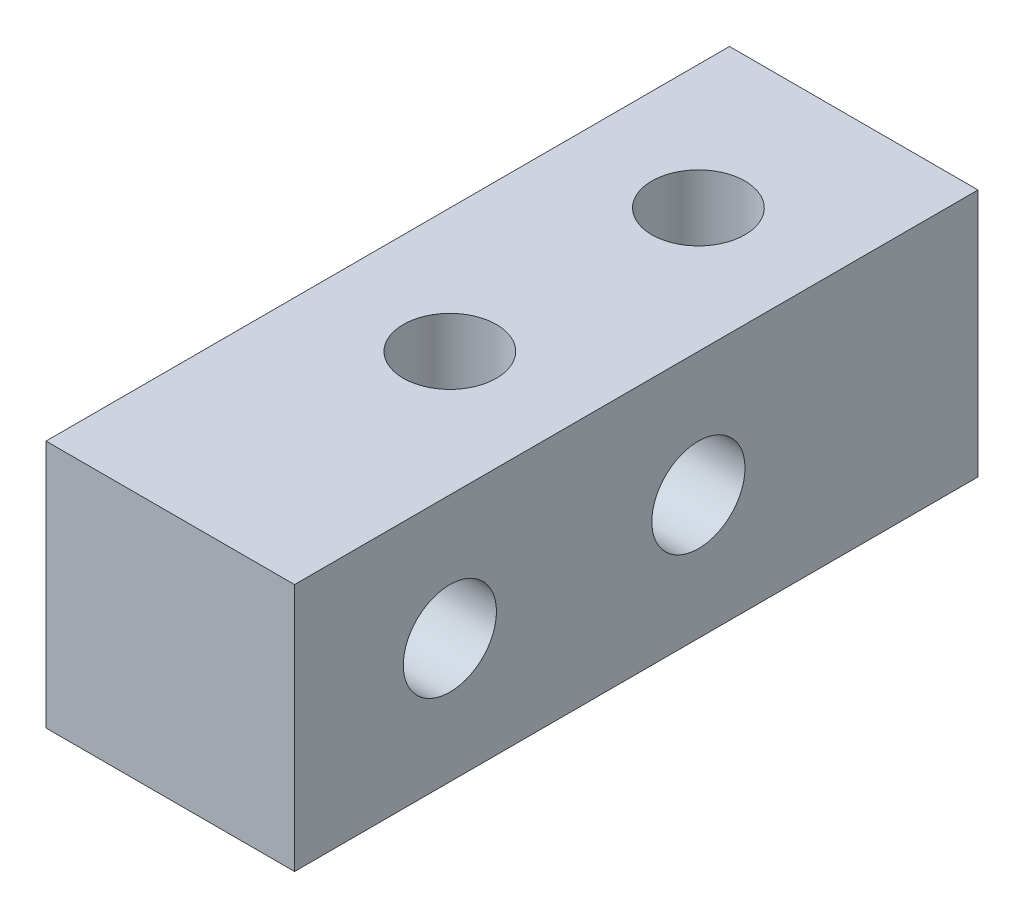
ISO-10303-21;
HEADER;
FILE_DESCRIPTION(('STEP AP214'),'2;1');
FILE_NAME('part.step','',(''),(''),'','','');
FILE_SCHEMA(('AUTOMOTIVE_DESIGN { 1 0 10303 214 1 1 1 1 }'));
ENDSEC;
DATA;
#1=APPLICATION_CONTEXT('core data for automotive mechanical design processes');
#2=APPLICATION_PROTOCOL_DEFINITION('international standard','automotive_design',2000,#1);
#3=PRODUCT_CONTEXT('',#1,'mechanical');
#4=PRODUCT('Part','Part','',(#3));
#5=PRODUCT_RELATED_PRODUCT_CATEGORY('part','',(#4));
#6=PRODUCT_DEFINITION_FORMATION('','',#4);
#7=PRODUCT_DEFINITION_CONTEXT('part definition',#1,'design');
#8=PRODUCT_DEFINITION('design','',#6,#7);
#9=PRODUCT_DEFINITION_SHAPE('','',#8);
#10=(LENGTH_UNIT() NAMED_UNIT(*) SI_UNIT(.MILLI.,.METRE.));
#11=(NAMED_UNIT(*) PLANE_ANGLE_UNIT() SI_UNIT($,.RADIAN.));
#12=(NAMED_UNIT(*) SI_UNIT($,.STERADIAN.) SOLID_ANGLE_UNIT());
#13=UNCERTAINTY_MEASURE_WITH_UNIT(LENGTH_MEASURE(1.E-05),#10,'distance_accuracy_value','');
#14=(GEOMETRIC_REPRESENTATION_CONTEXT(3) GLOBAL_UNCERTAINTY_ASSIGNED_CONTEXT((#13)) GLOBAL_UNIT_ASSIGNED_CONTEXT((#10,
#11,#12)) REPRESENTATION_CONTEXT('',''));
#15=CARTESIAN_POINT('',(0.,0.,0.));
#16=DIRECTION('',(0.,0.,1.));
#17=DIRECTION('',(1.,0.,0.));
#18=AXIS2_PLACEMENT_3D('',#15,#16,#17);
#19=CARTESIAN_POINT('',(4.,4.,22.));
#20=DIRECTION('',(-1.,0.,0.));
#21=DIRECTION('',(0.,0.,1.));
#22=AXIS2_PLACEMENT_3D('',#19,#20,#21);
#23=PLANE('',#22);
#24=CARTESIAN_POINT('',(4.,0.,17.));
#25=DIRECTION('',(1.,0.,0.));
#26=DIRECTION('',(0.,0.,-1.));
#27=AXIS2_PLACEMENT_3D('',#24,#25,#26);
#28=CIRCLE('',#27,1.5);
#29=CARTESIAN_POINT('',(4.,0.,15.5));
#30=VERTEX_POINT('',#29);
#31=EDGE_CURVE('E130',#30,#30,#28,.T.);
#32=ORIENTED_EDGE('',*,*,#31,.F.);
#33=EDGE_LOOP('',(#32));
#34=FACE_BOUND('',#33,.T.);
#35=CARTESIAN_POINT('',(4.,0.,9.));
#36=DIRECTION('',(1.,0.,0.));
#37=DIRECTION('',(0.,0.,-1.));
#38=AXIS2_PLACEMENT_3D('',#35,#36,#37);
#39=CIRCLE('',#38,1.5);
#40=CARTESIAN_POINT('',(4.,0.,7.5));
#41=VERTEX_POINT('',#40);
#42=EDGE_CURVE('E124',#41,#41,#39,.T.);
#43=ORIENTED_EDGE('',*,*,#42,.F.);
#44=EDGE_LOOP('',(#43));
#45=FACE_BOUND('',#44,.T.);
#46=DIRECTION('',(0.,1.,0.));
#47=VECTOR('',#46,1.);
#48=CARTESIAN_POINT('',(4.,4.,0.));
#49=LINE('',#48,#47);
#50=CARTESIAN_POINT('',(4.,-4.,0.));
#51=VERTEX_POINT('',#50);
#52=CARTESIAN_POINT('',(4.,4.,0.));
#53=VERTEX_POINT('',#52);
#54=EDGE_CURVE('E98',#51,#53,#49,.T.);
#55=ORIENTED_EDGE('',*,*,#54,.T.);
#56=DIRECTION('',(0.,0.,-1.));
#57=VECTOR('',#56,1.);
#58=CARTESIAN_POINT('',(4.,4.,22.));
#59=LINE('',#58,#57);
#60=CARTESIAN_POINT('',(4.,4.,22.));
#61=VERTEX_POINT('',#60);
#62=EDGE_CURVE('E11',#61,#53,#59,.T.);
#63=ORIENTED_EDGE('',*,*,#62,.F.);
#64=DIRECTION('',(0.,1.,0.));
#65=VECTOR('',#64,1.);
#66=CARTESIAN_POINT('',(4.,4.,22.));
#67=LINE('',#66,#65);
#68=CARTESIAN_POINT('',(4.,-4.,22.));
#69=VERTEX_POINT('',#68);
#70=EDGE_CURVE('E86',#69,#61,#67,.T.);
#71=ORIENTED_EDGE('',*,*,#70,.F.);
#72=DIRECTION('',(0.,0.,-1.));
#73=VECTOR('',#72,1.);
#74=CARTESIAN_POINT('',(4.,-4.,22.));
#75=LINE('',#74,#73);
#76=EDGE_CURVE('E94',#69,#51,#75,.T.);
#77=ORIENTED_EDGE('',*,*,#76,.T.);
#78=EDGE_LOOP('',(#55,#63,#71,#77));
#79=FACE_BOUND('',#78,.T.);
#80=ADVANCED_FACE('F35',(#34,#45,#79),#23,.F.);
#81=CARTESIAN_POINT('',(-4.,4.,22.));
#82=DIRECTION('',(0.,-1.,0.));
#83=DIRECTION('',(0.,0.,-1.));
#84=AXIS2_PLACEMENT_3D('',#81,#82,#83);
#85=PLANE('',#84);
#86=CARTESIAN_POINT('',(0.,4.,5.));
#87=DIRECTION('',(0.,1.,0.));
#88=DIRECTION('',(0.,0.,1.));
#89=AXIS2_PLACEMENT_3D('',#86,#87,#88);
#90=CIRCLE('',#89,1.5);
#91=CARTESIAN_POINT('',(0.,4.,6.5));
#92=VERTEX_POINT('',#91);
#93=EDGE_CURVE('E119',#92,#92,#90,.T.);
#94=ORIENTED_EDGE('',*,*,#93,.F.);
#95=EDGE_LOOP('',(#94));
#96=FACE_BOUND('',#95,.T.);
#97=CARTESIAN_POINT('',(0.,4.,13.));
#98=DIRECTION('',(0.,1.,0.));
#99=DIRECTION('',(0.,0.,1.));
#100=AXIS2_PLACEMENT_3D('',#97,#98,#99);
#101=CIRCLE('',#100,1.5);
#102=CARTESIAN_POINT('',(0.,4.,14.5));
#103=VERTEX_POINT('',#102);
#104=EDGE_CURVE('E112',#103,#103,#101,.T.);
#105=ORIENTED_EDGE('',*,*,#104,.F.);
#106=EDGE_LOOP('',(#105));
#107=FACE_BOUND('',#106,.T.);
#108=DIRECTION('',(-1.,0.,0.));
#109=VECTOR('',#108,1.);
#110=CARTESIAN_POINT('',(-4.,4.,0.));
#111=LINE('',#110,#109);
#112=CARTESIAN_POINT('',(-4.,4.,0.));
#113=VERTEX_POINT('',#112);
#114=EDGE_CURVE('E90',#53,#113,#111,.T.);
#115=ORIENTED_EDGE('',*,*,#114,.T.);
#116=DIRECTION('',(0.,0.,-1.));
#117=VECTOR('',#116,1.);
#118=CARTESIAN_POINT('',(-4.,4.,22.));
#119=LINE('',#118,#117);
#120=CARTESIAN_POINT('',(-4.,4.,22.));
#121=VERTEX_POINT('',#120);
#122=EDGE_CURVE('E43',#121,#113,#119,.T.);
#123=ORIENTED_EDGE('',*,*,#122,.F.);
#124=DIRECTION('',(-1.,0.,0.));
#125=VECTOR('',#124,1.);
#126=CARTESIAN_POINT('',(-4.,4.,22.));
#127=LINE('',#126,#125);
#128=EDGE_CURVE('E81',#61,#121,#127,.T.);
#129=ORIENTED_EDGE('',*,*,#128,.F.);
#130=ORIENTED_EDGE('',*,*,#62,.T.);
#131=EDGE_LOOP('',(#115,#123,#129,#130));
#132=FACE_BOUND('',#131,.T.);
#133=ADVANCED_FACE('F89',(#96,#107,#132),#85,.F.);
#134=CARTESIAN_POINT('',(-4.,4.,22.));
#135=DIRECTION('',(1.,0.,0.));
#136=DIRECTION('',(0.,0.,-1.));
#137=AXIS2_PLACEMENT_3D('',#134,#135,#136);
#138=PLANE('',#137);
#139=CARTESIAN_POINT('',(-4.,0.,17.));
#140=DIRECTION('',(1.,0.,0.));
#141=DIRECTION('',(0.,0.,-1.));
#142=AXIS2_PLACEMENT_3D('',#139,#140,#141);
#143=CIRCLE('',#142,1.5);
#144=CARTESIAN_POINT('',(-4.,0.,15.5));
#145=VERTEX_POINT('',#144);
#146=EDGE_CURVE('E116',#145,#145,#143,.T.);
#147=ORIENTED_EDGE('',*,*,#146,.T.);
#148=EDGE_LOOP('',(#147));
#149=FACE_BOUND('',#148,.T.);
#150=CARTESIAN_POINT('',(-4.,0.,9.));
#151=DIRECTION('',(1.,0.,0.));
#152=DIRECTION('',(0.,0.,-1.));
#153=AXIS2_PLACEMENT_3D('',#150,#151,#152);
#154=CIRCLE('',#153,1.5);
#155=CARTESIAN_POINT('',(-4.,0.,7.5));
#156=VERTEX_POINT('',#155);
#157=EDGE_CURVE('E127',#156,#156,#154,.T.);
#158=ORIENTED_EDGE('',*,*,#157,.T.);
#159=EDGE_LOOP('',(#158));
#160=FACE_BOUND('',#159,.T.);
#161=DIRECTION('',(0.,-1.,0.));
#162=VECTOR('',#161,1.);
#163=CARTESIAN_POINT('',(-4.,4.,0.));
#164=LINE('',#163,#162);
#165=CARTESIAN_POINT('',(-4.,-4.,0.));
#166=VERTEX_POINT('',#165);
#167=EDGE_CURVE('E68',#113,#166,#164,.T.);
#168=ORIENTED_EDGE('',*,*,#167,.T.);
#169=DIRECTION('',(0.,0.,-1.));
#170=VECTOR('',#169,1.);
#171=CARTESIAN_POINT('',(-4.,-4.,22.));
#172=LINE('',#171,#170);
#173=CARTESIAN_POINT('',(-4.,-4.,22.));
#174=VERTEX_POINT('',#173);
#175=EDGE_CURVE('E91',#174,#166,#172,.T.);
#176=ORIENTED_EDGE('',*,*,#175,.F.);
#177=DIRECTION('',(0.,-1.,0.));
#178=VECTOR('',#177,1.);
#179=CARTESIAN_POINT('',(-4.,4.,22.));
#180=LINE('',#179,#178);
#181=EDGE_CURVE('E84',#121,#174,#180,.T.);
#182=ORIENTED_EDGE('',*,*,#181,.F.);
#183=ORIENTED_EDGE('',*,*,#122,.T.);
#184=EDGE_LOOP('',(#168,#176,#182,#183));
#185=FACE_BOUND('',#184,.T.);
#186=ADVANCED_FACE('F92',(#149,#160,#185),#138,.F.);
#187=CARTESIAN_POINT('',(-4.,-4.,22.));
#188=DIRECTION('',(0.,1.,0.));
#189=DIRECTION('',(0.,0.,1.));
#190=AXIS2_PLACEMENT_3D('',#187,#188,#189);
#191=PLANE('',#190);
#192=CARTESIAN_POINT('',(0.,-4.,5.));
#193=DIRECTION('',(0.,1.,0.));
#194=DIRECTION('',(0.,0.,1.));
#195=AXIS2_PLACEMENT_3D('',#192,#193,#194);
#196=CIRCLE('',#195,1.5);
#197=CARTESIAN_POINT('',(0.,-4.,6.5));
#198=VERTEX_POINT('',#197);
#199=EDGE_CURVE('E101',#198,#198,#196,.T.);
#200=ORIENTED_EDGE('',*,*,#199,.T.);
#201=EDGE_LOOP('',(#200));
#202=FACE_BOUND('',#201,.T.);
#203=CARTESIAN_POINT('',(0.,-4.,13.));
#204=DIRECTION('',(0.,1.,0.));
#205=DIRECTION('',(0.,0.,1.));
#206=AXIS2_PLACEMENT_3D('',#203,#204,#205);
#207=CIRCLE('',#206,1.5);
#208=CARTESIAN_POINT('',(0.,-4.,14.5));
#209=VERTEX_POINT('',#208);
#210=EDGE_CURVE('E115',#209,#209,#207,.T.);
#211=ORIENTED_EDGE('',*,*,#210,.T.);
#212=EDGE_LOOP('',(#211));
#213=FACE_BOUND('',#212,.T.);
#214=DIRECTION('',(1.,0.,0.));
#215=VECTOR('',#214,1.);
#216=CARTESIAN_POINT('',(-4.,-4.,0.));
#217=LINE('',#216,#215);
#218=EDGE_CURVE('E74',#166,#51,#217,.T.);
#219=ORIENTED_EDGE('',*,*,#218,.T.);
#220=ORIENTED_EDGE('',*,*,#76,.F.);
#221=DIRECTION('',(1.,0.,0.));
#222=VECTOR('',#221,1.);
#223=CARTESIAN_POINT('',(-4.,-4.,22.));
#224=LINE('',#223,#222);
#225=EDGE_CURVE('E51',#174,#69,#224,.T.);
#226=ORIENTED_EDGE('',*,*,#225,.F.);
#227=ORIENTED_EDGE('',*,*,#175,.T.);
#228=EDGE_LOOP('',(#219,#220,#226,#227));
#229=FACE_BOUND('',#228,.T.);
#230=ADVANCED_FACE('F106',(#202,#213,#229),#191,.F.);
#231=CARTESIAN_POINT('',(0.,0.,22.));
#232=DIRECTION('',(0.,0.,1.));
#233=DIRECTION('',(1.,0.,0.));
#234=AXIS2_PLACEMENT_3D('',#231,#232,#233);
#235=PLANE('',#234);
#236=ORIENTED_EDGE('',*,*,#70,.T.);
#237=ORIENTED_EDGE('',*,*,#128,.T.);
#238=ORIENTED_EDGE('',*,*,#181,.T.);
#239=ORIENTED_EDGE('',*,*,#225,.T.);
#240=EDGE_LOOP('',(#236,#237,#238,#239));
#241=FACE_BOUND('',#240,.T.);
#242=ADVANCED_FACE('F82',(#241),#235,.T.);
#243=CARTESIAN_POINT('',(0.,0.,0.));
#244=DIRECTION('',(0.,0.,1.));
#245=DIRECTION('',(1.,0.,0.));
#246=AXIS2_PLACEMENT_3D('',#243,#244,#245);
#247=PLANE('',#246);
#248=ORIENTED_EDGE('',*,*,#54,.F.);
#249=ORIENTED_EDGE('',*,*,#218,.F.);
#250=ORIENTED_EDGE('',*,*,#167,.F.);
#251=ORIENTED_EDGE('',*,*,#114,.F.);
#252=EDGE_LOOP('',(#248,#249,#250,#251));
#253=FACE_BOUND('',#252,.T.);
#254=ADVANCED_FACE('F109',(#253),#247,.F.);
#255=CARTESIAN_POINT('',(0.,-4.,13.));
#256=DIRECTION('',(0.,1.,0.));
#257=DIRECTION('',(0.,0.,1.));
#258=AXIS2_PLACEMENT_3D('',#255,#256,#257);
#259=CYLINDRICAL_SURFACE('',#258,1.5);
#260=ORIENTED_EDGE('',*,*,#210,.F.);
#261=EDGE_LOOP('',(#260));
#262=FACE_BOUND('',#261,.T.);
#263=ORIENTED_EDGE('',*,*,#104,.T.);
#264=EDGE_LOOP('',(#263));
#265=FACE_BOUND('',#264,.T.);
#266=ADVANCED_FACE('F156',(#262,#265),#259,.F.);
#267=CARTESIAN_POINT('',(0.,-4.,5.));
#268=DIRECTION('',(0.,1.,0.));
#269=DIRECTION('',(0.,0.,1.));
#270=AXIS2_PLACEMENT_3D('',#267,#268,#269);
#271=CYLINDRICAL_SURFACE('',#270,1.5);
#272=ORIENTED_EDGE('',*,*,#199,.F.);
#273=EDGE_LOOP('',(#272));
#274=FACE_BOUND('',#273,.T.);
#275=ORIENTED_EDGE('',*,*,#93,.T.);
#276=EDGE_LOOP('',(#275));
#277=FACE_BOUND('',#276,.T.);
#278=ADVANCED_FACE('F150',(#274,#277),#271,.F.);
#279=CARTESIAN_POINT('',(-4.,0.,9.));
#280=DIRECTION('',(1.,0.,0.));
#281=DIRECTION('',(0.,0.,-1.));
#282=AXIS2_PLACEMENT_3D('',#279,#280,#281);
#283=CYLINDRICAL_SURFACE('',#282,1.5);
#284=ORIENTED_EDGE('',*,*,#157,.F.);
#285=EDGE_LOOP('',(#284));
#286=FACE_BOUND('',#285,.T.);
#287=ORIENTED_EDGE('',*,*,#42,.T.);
#288=EDGE_LOOP('',(#287));
#289=FACE_BOUND('',#288,.T.);
#290=ADVANCED_FACE('F141',(#286,#289),#283,.F.);
#291=CARTESIAN_POINT('',(-4.,0.,17.));
#292=DIRECTION('',(1.,0.,0.));
#293=DIRECTION('',(0.,0.,-1.));
#294=AXIS2_PLACEMENT_3D('',#291,#292,#293);
#295=CYLINDRICAL_SURFACE('',#294,1.5);
#296=ORIENTED_EDGE('',*,*,#146,.F.);
#297=EDGE_LOOP('',(#296));
#298=FACE_BOUND('',#297,.T.);
#299=ORIENTED_EDGE('',*,*,#31,.T.);
#300=EDGE_LOOP('',(#299));
#301=FACE_BOUND('',#300,.T.);
#302=ADVANCED_FACE('F138',(#298,#301),#295,.F.);
#303=CLOSED_SHELL('',(#80,#133,#186,#230,#242,#254,#266,#278,#290,#302));
#304=MANIFOLD_SOLID_BREP('B2',#303);
#305=ADVANCED_BREP_SHAPE_REPRESENTATION('',(#18,#304),#14);
#306=SHAPE_DEFINITION_REPRESENTATION(#9,#305);
ENDSEC;
END-ISO-10303-21;
